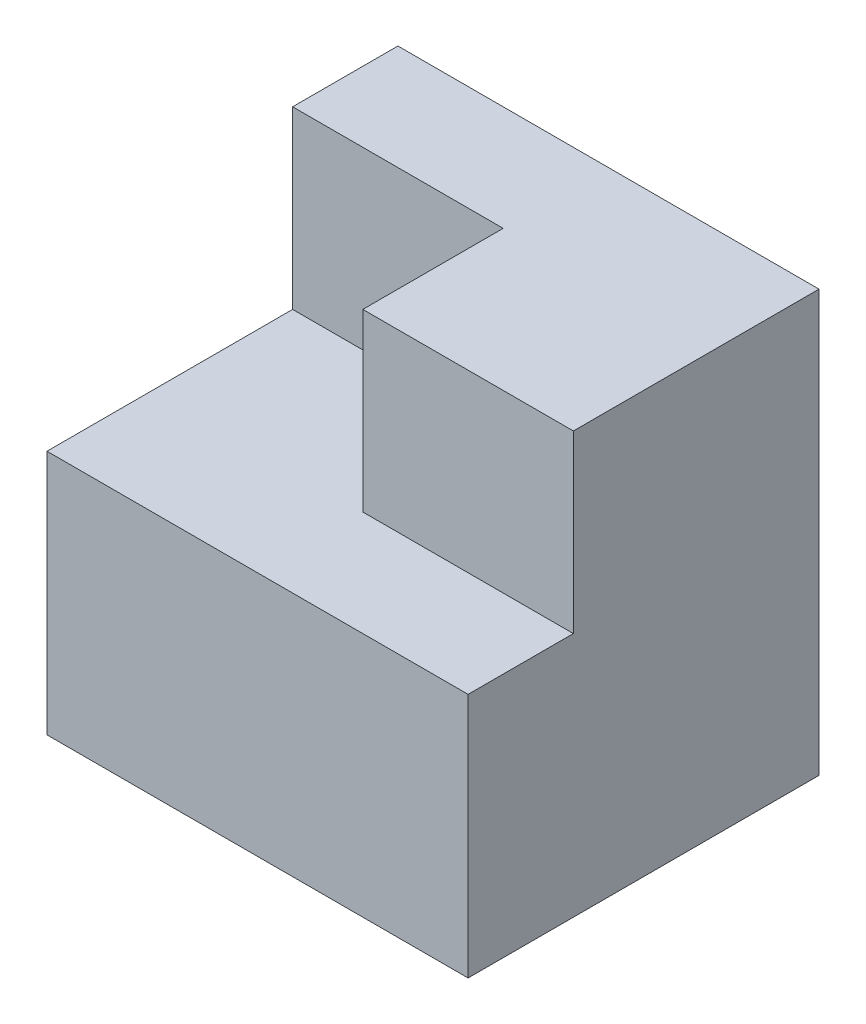
ISO-10303-21;
HEADER;
FILE_DESCRIPTION(('STEP AP214'),'2;1');
FILE_NAME('part.step','',(''),(''),'','','');
FILE_SCHEMA(('AUTOMOTIVE_DESIGN { 1 0 10303 214 1 1 1 1 }'));
ENDSEC;
DATA;
#1=APPLICATION_CONTEXT('core data for automotive mechanical design processes');
#2=APPLICATION_PROTOCOL_DEFINITION('international standard','automotive_design',2000,#1);
#3=PRODUCT_CONTEXT('',#1,'mechanical');
#4=PRODUCT('Part','Part','',(#3));
#5=PRODUCT_RELATED_PRODUCT_CATEGORY('part','',(#4));
#6=PRODUCT_DEFINITION_FORMATION('','',#4);
#7=PRODUCT_DEFINITION_CONTEXT('part definition',#1,'design');
#8=PRODUCT_DEFINITION('design','',#6,#7);
#9=PRODUCT_DEFINITION_SHAPE('','',#8);
#10=(LENGTH_UNIT() NAMED_UNIT(*) SI_UNIT(.MILLI.,.METRE.));
#11=(NAMED_UNIT(*) PLANE_ANGLE_UNIT() SI_UNIT($,.RADIAN.));
#12=(NAMED_UNIT(*) SI_UNIT($,.STERADIAN.) SOLID_ANGLE_UNIT());
#13=UNCERTAINTY_MEASURE_WITH_UNIT(LENGTH_MEASURE(1.E-05),#10,'distance_accuracy_value','');
#14=(GEOMETRIC_REPRESENTATION_CONTEXT(3) GLOBAL_UNCERTAINTY_ASSIGNED_CONTEXT((#13)) GLOBAL_UNIT_ASSIGNED_CONTEXT((#10,
#11,#12)) REPRESENTATION_CONTEXT('',''));
#15=CARTESIAN_POINT('',(0.,0.,0.));
#16=DIRECTION('',(0.,0.,1.));
#17=DIRECTION('',(1.,0.,0.));
#18=AXIS2_PLACEMENT_3D('',#15,#16,#17);
#19=CARTESIAN_POINT('',(-3.,6.,2.5));
#20=DIRECTION('',(0.,0.,-1.));
#21=DIRECTION('',(-1.,0.,0.));
#22=AXIS2_PLACEMENT_3D('',#19,#20,#21);
#23=PLANE('',#22);
#24=DIRECTION('',(1.,0.,0.));
#25=VECTOR('',#24,1.);
#26=CARTESIAN_POINT('',(-3.,3.5,2.5));
#27=LINE('',#26,#25);
#28=CARTESIAN_POINT('',(-3.,3.5,2.5));
#29=VERTEX_POINT('',#28);
#30=CARTESIAN_POINT('',(3.,3.5,2.5));
#31=VERTEX_POINT('',#30);
#32=EDGE_CURVE('E123',#29,#31,#27,.T.);
#33=ORIENTED_EDGE('',*,*,#32,.F.);
#34=DIRECTION('',(0.,-1.,0.));
#35=VECTOR('',#34,1.);
#36=CARTESIAN_POINT('',(-3.,6.,2.5));
#37=LINE('',#36,#35);
#38=CARTESIAN_POINT('',(-3.,0.,2.5));
#39=VERTEX_POINT('',#38);
#40=EDGE_CURVE('E87',#29,#39,#37,.T.);
#41=ORIENTED_EDGE('',*,*,#40,.T.);
#42=DIRECTION('',(1.,0.,0.));
#43=VECTOR('',#42,1.);
#44=CARTESIAN_POINT('',(-3.,0.,2.5));
#45=LINE('',#44,#43);
#46=CARTESIAN_POINT('',(3.,0.,2.5));
#47=VERTEX_POINT('',#46);
#48=EDGE_CURVE('E91',#39,#47,#45,.T.);
#49=ORIENTED_EDGE('',*,*,#48,.T.);
#50=DIRECTION('',(0.,-1.,0.));
#51=VECTOR('',#50,1.);
#52=CARTESIAN_POINT('',(3.,6.,2.5));
#53=LINE('',#52,#51);
#54=EDGE_CURVE('E77',#31,#47,#53,.T.);
#55=ORIENTED_EDGE('',*,*,#54,.F.);
#56=EDGE_LOOP('',(#33,#41,#49,#55));
#57=FACE_BOUND('',#56,.T.);
#58=ADVANCED_FACE('F33',(#57),#23,.F.);
#59=CARTESIAN_POINT('',(3.,6.,2.5));
#60=DIRECTION('',(-1.,0.,0.));
#61=DIRECTION('',(0.,0.,1.));
#62=AXIS2_PLACEMENT_3D('',#59,#60,#61);
#63=PLANE('',#62);
#64=DIRECTION('',(0.,0.,-1.));
#65=VECTOR('',#64,1.);
#66=CARTESIAN_POINT('',(3.,6.,2.5));
#67=LINE('',#66,#65);
#68=CARTESIAN_POINT('',(3.,6.,1.));
#69=VERTEX_POINT('',#68);
#70=CARTESIAN_POINT('',(3.,6.,-2.5));
#71=VERTEX_POINT('',#70);
#72=EDGE_CURVE('E96',#69,#71,#67,.T.);
#73=ORIENTED_EDGE('',*,*,#72,.F.);
#74=DIRECTION('',(0.,1.,0.));
#75=VECTOR('',#74,1.);
#76=CARTESIAN_POINT('',(3.,3.5,1.));
#77=LINE('',#76,#75);
#78=CARTESIAN_POINT('',(3.,3.5,1.));
#79=VERTEX_POINT('',#78);
#80=EDGE_CURVE('E48',#79,#69,#77,.T.);
#81=ORIENTED_EDGE('',*,*,#80,.F.);
#82=DIRECTION('',(0.,0.,-1.));
#83=VECTOR('',#82,1.);
#84=CARTESIAN_POINT('',(3.,3.5,2.5));
#85=LINE('',#84,#83);
#86=EDGE_CURVE('E84',#31,#79,#85,.T.);
#87=ORIENTED_EDGE('',*,*,#86,.F.);
#88=ORIENTED_EDGE('',*,*,#54,.T.);
#89=DIRECTION('',(0.,0.,-1.));
#90=VECTOR('',#89,1.);
#91=CARTESIAN_POINT('',(3.,0.,2.5));
#92=LINE('',#91,#90);
#93=CARTESIAN_POINT('',(3.,0.,-2.5));
#94=VERTEX_POINT('',#93);
#95=EDGE_CURVE('E82',#47,#94,#92,.T.);
#96=ORIENTED_EDGE('',*,*,#95,.T.);
#97=DIRECTION('',(0.,-1.,0.));
#98=VECTOR('',#97,1.);
#99=CARTESIAN_POINT('',(3.,6.,-2.5));
#100=LINE('',#99,#98);
#101=EDGE_CURVE('E11',#71,#94,#100,.T.);
#102=ORIENTED_EDGE('',*,*,#101,.F.);
#103=EDGE_LOOP('',(#73,#81,#87,#88,#96,#102));
#104=FACE_BOUND('',#103,.T.);
#105=ADVANCED_FACE('F35',(#104),#63,.F.);
#106=CARTESIAN_POINT('',(-3.,6.,-2.5));
#107=DIRECTION('',(0.,0.,1.));
#108=DIRECTION('',(1.,0.,0.));
#109=AXIS2_PLACEMENT_3D('',#106,#107,#108);
#110=PLANE('',#109);
#111=DIRECTION('',(-1.,0.,0.));
#112=VECTOR('',#111,1.);
#113=CARTESIAN_POINT('',(-3.,0.,-2.5));
#114=LINE('',#113,#112);
#115=CARTESIAN_POINT('',(-3.,0.,-2.5));
#116=VERTEX_POINT('',#115);
#117=EDGE_CURVE('E100',#94,#116,#114,.T.);
#118=ORIENTED_EDGE('',*,*,#117,.T.);
#119=DIRECTION('',(0.,-1.,0.));
#120=VECTOR('',#119,1.);
#121=CARTESIAN_POINT('',(-3.,6.,-2.5));
#122=LINE('',#121,#120);
#123=CARTESIAN_POINT('',(-3.,6.,-2.5));
#124=VERTEX_POINT('',#123);
#125=EDGE_CURVE('E41',#124,#116,#122,.T.);
#126=ORIENTED_EDGE('',*,*,#125,.F.);
#127=DIRECTION('',(-1.,0.,0.));
#128=VECTOR('',#127,1.);
#129=CARTESIAN_POINT('',(-3.,6.,-2.5));
#130=LINE('',#129,#128);
#131=EDGE_CURVE('E57',#71,#124,#130,.T.);
#132=ORIENTED_EDGE('',*,*,#131,.F.);
#133=ORIENTED_EDGE('',*,*,#101,.T.);
#134=EDGE_LOOP('',(#118,#126,#132,#133));
#135=FACE_BOUND('',#134,.T.);
#136=ADVANCED_FACE('F117',(#135),#110,.F.);
#137=CARTESIAN_POINT('',(-3.,6.,2.5));
#138=DIRECTION('',(1.,0.,0.));
#139=DIRECTION('',(0.,0.,-1.));
#140=AXIS2_PLACEMENT_3D('',#137,#138,#139);
#141=PLANE('',#140);
#142=DIRECTION('',(0.,0.,1.));
#143=VECTOR('',#142,1.);
#144=CARTESIAN_POINT('',(-3.,3.5,-1.));
#145=LINE('',#144,#143);
#146=CARTESIAN_POINT('',(-3.,3.5,-1.));
#147=VERTEX_POINT('',#146);
#148=EDGE_CURVE('E138',#147,#29,#145,.T.);
#149=ORIENTED_EDGE('',*,*,#148,.F.);
#150=DIRECTION('',(0.,1.,0.));
#151=VECTOR('',#150,1.);
#152=CARTESIAN_POINT('',(-3.,3.5,-1.));
#153=LINE('',#152,#151);
#154=CARTESIAN_POINT('',(-3.,6.,-1.));
#155=VERTEX_POINT('',#154);
#156=EDGE_CURVE('E101',#147,#155,#153,.T.);
#157=ORIENTED_EDGE('',*,*,#156,.T.);
#158=DIRECTION('',(0.,0.,1.));
#159=VECTOR('',#158,1.);
#160=CARTESIAN_POINT('',(-3.,6.,2.5));
#161=LINE('',#160,#159);
#162=EDGE_CURVE('E88',#124,#155,#161,.T.);
#163=ORIENTED_EDGE('',*,*,#162,.F.);
#164=ORIENTED_EDGE('',*,*,#125,.T.);
#165=DIRECTION('',(0.,0.,1.));
#166=VECTOR('',#165,1.);
#167=CARTESIAN_POINT('',(-3.,0.,2.5));
#168=LINE('',#167,#166);
#169=EDGE_CURVE('E97',#116,#39,#168,.T.);
#170=ORIENTED_EDGE('',*,*,#169,.T.);
#171=ORIENTED_EDGE('',*,*,#40,.F.);
#172=EDGE_LOOP('',(#149,#157,#163,#164,#170,#171));
#173=FACE_BOUND('',#172,.T.);
#174=ADVANCED_FACE('F115',(#173),#141,.F.);
#175=CARTESIAN_POINT('',(0.,6.,0.));
#176=DIRECTION('',(0.,-1.,0.));
#177=DIRECTION('',(0.,0.,-1.));
#178=AXIS2_PLACEMENT_3D('',#175,#176,#177);
#179=PLANE('',#178);
#180=ORIENTED_EDGE('',*,*,#162,.T.);
#181=DIRECTION('',(-1.,0.,0.));
#182=VECTOR('',#181,1.);
#183=CARTESIAN_POINT('',(0.,6.,-1.));
#184=LINE('',#183,#182);
#185=CARTESIAN_POINT('',(0.,6.,-1.));
#186=VERTEX_POINT('',#185);
#187=EDGE_CURVE('E128',#186,#155,#184,.T.);
#188=ORIENTED_EDGE('',*,*,#187,.F.);
#189=DIRECTION('',(0.,0.,-1.));
#190=VECTOR('',#189,1.);
#191=CARTESIAN_POINT('',(0.,6.,1.));
#192=LINE('',#191,#190);
#193=CARTESIAN_POINT('',(0.,6.,1.));
#194=VERTEX_POINT('',#193);
#195=EDGE_CURVE('E131',#194,#186,#192,.T.);
#196=ORIENTED_EDGE('',*,*,#195,.F.);
#197=DIRECTION('',(-1.,0.,0.));
#198=VECTOR('',#197,1.);
#199=CARTESIAN_POINT('',(3.,6.,1.));
#200=LINE('',#199,#198);
#201=EDGE_CURVE('E134',#69,#194,#200,.T.);
#202=ORIENTED_EDGE('',*,*,#201,.F.);
#203=ORIENTED_EDGE('',*,*,#72,.T.);
#204=ORIENTED_EDGE('',*,*,#131,.T.);
#205=EDGE_LOOP('',(#180,#188,#196,#202,#203,#204));
#206=FACE_BOUND('',#205,.T.);
#207=ADVANCED_FACE('F178',(#206),#179,.F.);
#208=CARTESIAN_POINT('',(0.,0.,0.));
#209=DIRECTION('',(0.,-1.,0.));
#210=DIRECTION('',(0.,0.,-1.));
#211=AXIS2_PLACEMENT_3D('',#208,#209,#210);
#212=PLANE('',#211);
#213=ORIENTED_EDGE('',*,*,#95,.F.);
#214=ORIENTED_EDGE('',*,*,#48,.F.);
#215=ORIENTED_EDGE('',*,*,#169,.F.);
#216=ORIENTED_EDGE('',*,*,#117,.F.);
#217=EDGE_LOOP('',(#213,#214,#215,#216));
#218=FACE_BOUND('',#217,.T.);
#219=ADVANCED_FACE('F99',(#218),#212,.T.);
#220=CARTESIAN_POINT('',(0.,3.5,-1.));
#221=DIRECTION('',(0.,0.,-1.));
#222=DIRECTION('',(-1.,0.,0.));
#223=AXIS2_PLACEMENT_3D('',#220,#221,#222);
#224=PLANE('',#223);
#225=ORIENTED_EDGE('',*,*,#187,.T.);
#226=ORIENTED_EDGE('',*,*,#156,.F.);
#227=DIRECTION('',(-1.,0.,0.));
#228=VECTOR('',#227,1.);
#229=CARTESIAN_POINT('',(0.,3.5,-1.));
#230=LINE('',#229,#228);
#231=CARTESIAN_POINT('',(0.,3.5,-1.));
#232=VERTEX_POINT('',#231);
#233=EDGE_CURVE('E141',#232,#147,#230,.T.);
#234=ORIENTED_EDGE('',*,*,#233,.F.);
#235=DIRECTION('',(0.,1.,0.));
#236=VECTOR('',#235,1.);
#237=CARTESIAN_POINT('',(0.,3.5,-1.));
#238=LINE('',#237,#236);
#239=EDGE_CURVE('E105',#232,#186,#238,.T.);
#240=ORIENTED_EDGE('',*,*,#239,.T.);
#241=EDGE_LOOP('',(#225,#226,#234,#240));
#242=FACE_BOUND('',#241,.T.);
#243=ADVANCED_FACE('F172',(#242),#224,.F.);
#244=CARTESIAN_POINT('',(0.,3.5,1.));
#245=DIRECTION('',(1.,0.,0.));
#246=DIRECTION('',(0.,0.,-1.));
#247=AXIS2_PLACEMENT_3D('',#244,#245,#246);
#248=PLANE('',#247);
#249=ORIENTED_EDGE('',*,*,#195,.T.);
#250=ORIENTED_EDGE('',*,*,#239,.F.);
#251=DIRECTION('',(0.,0.,-1.));
#252=VECTOR('',#251,1.);
#253=CARTESIAN_POINT('',(0.,3.5,1.));
#254=LINE('',#253,#252);
#255=CARTESIAN_POINT('',(0.,3.5,1.));
#256=VERTEX_POINT('',#255);
#257=EDGE_CURVE('E144',#256,#232,#254,.T.);
#258=ORIENTED_EDGE('',*,*,#257,.F.);
#259=DIRECTION('',(0.,1.,0.));
#260=VECTOR('',#259,1.);
#261=CARTESIAN_POINT('',(0.,3.5,1.));
#262=LINE('',#261,#260);
#263=EDGE_CURVE('E122',#256,#194,#262,.T.);
#264=ORIENTED_EDGE('',*,*,#263,.T.);
#265=EDGE_LOOP('',(#249,#250,#258,#264));
#266=FACE_BOUND('',#265,.T.);
#267=ADVANCED_FACE('F177',(#266),#248,.F.);
#268=CARTESIAN_POINT('',(3.,3.5,1.));
#269=DIRECTION('',(0.,0.,-1.));
#270=DIRECTION('',(-1.,0.,0.));
#271=AXIS2_PLACEMENT_3D('',#268,#269,#270);
#272=PLANE('',#271);
#273=ORIENTED_EDGE('',*,*,#201,.T.);
#274=ORIENTED_EDGE('',*,*,#263,.F.);
#275=DIRECTION('',(-1.,0.,0.));
#276=VECTOR('',#275,1.);
#277=CARTESIAN_POINT('',(3.,3.5,1.));
#278=LINE('',#277,#276);
#279=EDGE_CURVE('E147',#79,#256,#278,.T.);
#280=ORIENTED_EDGE('',*,*,#279,.F.);
#281=ORIENTED_EDGE('',*,*,#80,.T.);
#282=EDGE_LOOP('',(#273,#274,#280,#281));
#283=FACE_BOUND('',#282,.T.);
#284=ADVANCED_FACE('F228',(#283),#272,.F.);
#285=CARTESIAN_POINT('',(0.,3.5,0.));
#286=DIRECTION('',(0.,1.,0.));
#287=DIRECTION('',(0.,0.,1.));
#288=AXIS2_PLACEMENT_3D('',#285,#286,#287);
#289=PLANE('',#288);
#290=ORIENTED_EDGE('',*,*,#86,.T.);
#291=ORIENTED_EDGE('',*,*,#279,.T.);
#292=ORIENTED_EDGE('',*,*,#257,.T.);
#293=ORIENTED_EDGE('',*,*,#233,.T.);
#294=ORIENTED_EDGE('',*,*,#148,.T.);
#295=ORIENTED_EDGE('',*,*,#32,.T.);
#296=EDGE_LOOP('',(#290,#291,#292,#293,#294,#295));
#297=FACE_BOUND('',#296,.T.);
#298=ADVANCED_FACE('F151',(#297),#289,.T.);
#299=CLOSED_SHELL('',(#58,#105,#136,#174,#207,#219,#243,#267,#284,#298));
#300=MANIFOLD_SOLID_BREP('B2',#299);
#301=ADVANCED_BREP_SHAPE_REPRESENTATION('',(#18,#300),#14);
#302=SHAPE_DEFINITION_REPRESENTATION(#9,#301);
ENDSEC;
END-ISO-10303-21;
